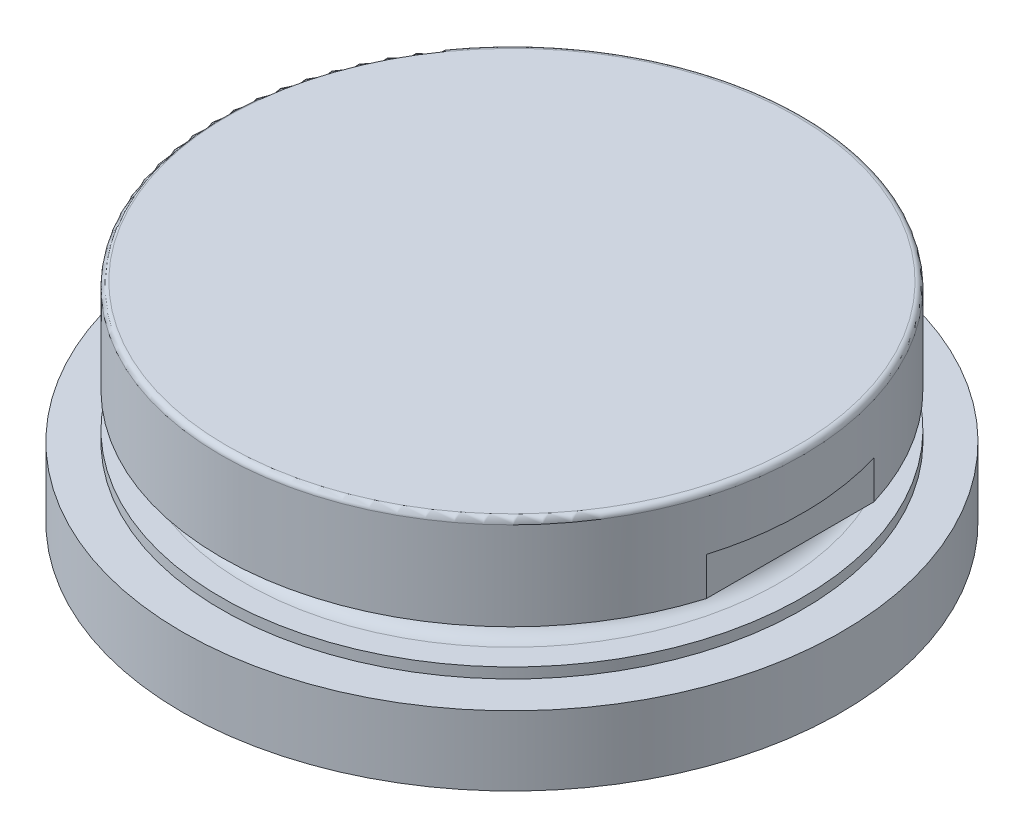
ISO-10303-21;
HEADER;
FILE_DESCRIPTION(('STEP AP214'),'2;1');
FILE_NAME('part.step','',(''),(''),'','','');
FILE_SCHEMA(('AUTOMOTIVE_DESIGN { 1 0 10303 214 1 1 1 1 }'));
ENDSEC;
DATA;
#1=APPLICATION_CONTEXT('core data for automotive mechanical design processes');
#2=APPLICATION_PROTOCOL_DEFINITION('international standard','automotive_design',2000,#1);
#3=PRODUCT_CONTEXT('',#1,'mechanical');
#4=PRODUCT('Part','Part','',(#3));
#5=PRODUCT_RELATED_PRODUCT_CATEGORY('part','',(#4));
#6=PRODUCT_DEFINITION_FORMATION('','',#4);
#7=PRODUCT_DEFINITION_CONTEXT('part definition',#1,'design');
#8=PRODUCT_DEFINITION('design','',#6,#7);
#9=PRODUCT_DEFINITION_SHAPE('','',#8);
#10=(LENGTH_UNIT() NAMED_UNIT(*) SI_UNIT(.MILLI.,.METRE.));
#11=(NAMED_UNIT(*) PLANE_ANGLE_UNIT() SI_UNIT($,.RADIAN.));
#12=(NAMED_UNIT(*) SI_UNIT($,.STERADIAN.) SOLID_ANGLE_UNIT());
#13=UNCERTAINTY_MEASURE_WITH_UNIT(LENGTH_MEASURE(1.E-05),#10,'distance_accuracy_value','');
#14=(GEOMETRIC_REPRESENTATION_CONTEXT(3) GLOBAL_UNCERTAINTY_ASSIGNED_CONTEXT((#13)) GLOBAL_UNIT_ASSIGNED_CONTEXT((#10,
#11,#12)) REPRESENTATION_CONTEXT('',''));
#15=CARTESIAN_POINT('',(0.,0.,0.));
#16=DIRECTION('',(0.,0.,1.));
#17=DIRECTION('',(1.,0.,0.));
#18=AXIS2_PLACEMENT_3D('',#15,#16,#17);
#19=CARTESIAN_POINT('',(0.,19.05,0.));
#20=DIRECTION('',(0.,-1.,0.));
#21=DIRECTION('',(0.,0.,-1.));
#22=AXIS2_PLACEMENT_3D('',#19,#20,#21);
#23=CYLINDRICAL_SURFACE('',#22,26.543);
#24=CARTESIAN_POINT('',(0.,6.35,0.));
#25=DIRECTION('',(0.,1.,0.));
#26=DIRECTION('',(0.,0.,1.));
#27=AXIS2_PLACEMENT_3D('',#24,#25,#26);
#28=CIRCLE('',#27,26.543);
#29=CARTESIAN_POINT('',(0.,6.35,-26.543));
#30=VERTEX_POINT('',#29);
#31=EDGE_CURVE('E171',#30,#30,#28,.F.);
#32=CARTESIAN_POINT('',(0.,7.3025,0.));
#33=DIRECTION('',(0.,1.,0.));
#34=DIRECTION('',(0.,0.,1.));
#35=AXIS2_PLACEMENT_3D('',#32,#33,#34);
#36=CIRCLE('',#35,26.543);
#37=CARTESIAN_POINT('',(0.,7.30249999999999,-26.543));
#38=VERTEX_POINT('',#37);
#39=EDGE_CURVE('E39',#38,#38,#36,.T.);
#40=CARTESIAN_POINT('',(0.,6.35,-26.543));
#41=CARTESIAN_POINT('',(0.,6.359921875,-26.543));
#42=CARTESIAN_POINT('',(0.,6.36984375,-26.543));
#43=CARTESIAN_POINT('',(0.,6.3896875,-26.543));
#44=CARTESIAN_POINT('',(0.,6.399609375,-26.543));
#45=CARTESIAN_POINT('',(0.,6.419453125,-26.543));
#46=CARTESIAN_POINT('',(0.,6.429375,-26.543));
#47=CARTESIAN_POINT('',(0.,6.44921875,-26.543));
#48=CARTESIAN_POINT('',(0.,6.459140625,-26.543));
#49=CARTESIAN_POINT('',(0.,6.478984375,-26.543));
#50=CARTESIAN_POINT('',(0.,6.48890625,-26.543));
#51=CARTESIAN_POINT('',(0.,6.50875,-26.543));
#52=CARTESIAN_POINT('',(0.,6.518671875,-26.543));
#53=CARTESIAN_POINT('',(0.,6.538515625,-26.543));
#54=CARTESIAN_POINT('',(0.,6.5484375,-26.543));
#55=CARTESIAN_POINT('',(0.,6.56828125,-26.543));
#56=CARTESIAN_POINT('',(0.,6.578203125,-26.543));
#57=CARTESIAN_POINT('',(0.,6.598046875,-26.543));
#58=CARTESIAN_POINT('',(0.,6.60796875,-26.543));
#59=CARTESIAN_POINT('',(0.,6.6278125,-26.543));
#60=CARTESIAN_POINT('',(0.,6.637734375,-26.543));
#61=CARTESIAN_POINT('',(0.,6.657578125,-26.543));
#62=CARTESIAN_POINT('',(0.,6.6675,-26.543));
#63=CARTESIAN_POINT('',(0.,6.68734375,-26.543));
#64=CARTESIAN_POINT('',(0.,6.697265625,-26.543));
#65=CARTESIAN_POINT('',(0.,6.717109375,-26.543));
#66=CARTESIAN_POINT('',(0.,6.72703125,-26.543));
#67=CARTESIAN_POINT('',(0.,6.746875,-26.543));
#68=CARTESIAN_POINT('',(0.,6.756796875,-26.543));
#69=CARTESIAN_POINT('',(0.,6.776640625,-26.543));
#70=CARTESIAN_POINT('',(0.,6.7865625,-26.543));
#71=CARTESIAN_POINT('',(0.,6.80640625,-26.543));
#72=CARTESIAN_POINT('',(0.,6.816328125,-26.543));
#73=CARTESIAN_POINT('',(0.,6.836171875,-26.543));
#74=CARTESIAN_POINT('',(0.,6.84609375,-26.543));
#75=CARTESIAN_POINT('',(0.,6.8659375,-26.543));
#76=CARTESIAN_POINT('',(0.,6.875859375,-26.543));
#77=CARTESIAN_POINT('',(0.,6.895703125,-26.543));
#78=CARTESIAN_POINT('',(0.,6.905625,-26.543));
#79=CARTESIAN_POINT('',(0.,6.92546875,-26.543));
#80=CARTESIAN_POINT('',(0.,6.935390625,-26.543));
#81=CARTESIAN_POINT('',(0.,6.955234375,-26.543));
#82=CARTESIAN_POINT('',(0.,6.96515625,-26.543));
#83=CARTESIAN_POINT('',(0.,6.985,-26.543));
#84=CARTESIAN_POINT('',(0.,6.994921875,-26.543));
#85=CARTESIAN_POINT('',(0.,7.014765625,-26.543));
#86=CARTESIAN_POINT('',(0.,7.0246875,-26.543));
#87=CARTESIAN_POINT('',(0.,7.04453125,-26.543));
#88=CARTESIAN_POINT('',(0.,7.054453125,-26.543));
#89=CARTESIAN_POINT('',(0.,7.074296875,-26.543));
#90=CARTESIAN_POINT('',(0.,7.08421875,-26.543));
#91=CARTESIAN_POINT('',(0.,7.1040625,-26.543));
#92=CARTESIAN_POINT('',(0.,7.113984375,-26.543));
#93=CARTESIAN_POINT('',(0.,7.133828125,-26.543));
#94=CARTESIAN_POINT('',(0.,7.14374999999999,-26.543));
#95=CARTESIAN_POINT('',(0.,7.16359374999999,-26.543));
#96=CARTESIAN_POINT('',(0.,7.173515625,-26.543));
#97=CARTESIAN_POINT('',(0.,7.193359375,-26.543));
#98=CARTESIAN_POINT('',(0.,7.20328125,-26.543));
#99=CARTESIAN_POINT('',(0.,7.223125,-26.543));
#100=CARTESIAN_POINT('',(0.,7.23304687499999,-26.543));
#101=CARTESIAN_POINT('',(0.,7.25289062499999,-26.543));
#102=CARTESIAN_POINT('',(0.,7.26281249999999,-26.543));
#103=CARTESIAN_POINT('',(0.,7.28265624999999,-26.543));
#104=CARTESIAN_POINT('',(0.,7.292578125,-26.543));
#105=CARTESIAN_POINT('',(0.,7.30249999999999,-26.543));
#106=B_SPLINE_CURVE_WITH_KNOTS('',3,(#40,#41,#42,#43,#44,#45,#46,#47,#48,#49,#50,#51,#52,#53,
#54,#55,#56,#57,#58,#59,#60,#61,#62,#63,#64,#65,#66,#67,#68,#69,#70,#71,#72,#73,#74,#75,#76,#77,
#78,#79,#80,#81,#82,#83,#84,#85,#86,#87,#88,#89,#90,#91,#92,#93,#94,#95,#96,#97,#98,#99,#100,
#101,#102,#103,#104,#105),.UNSPECIFIED.,.F.,.F.,(4,2,2,2,2,2,2,2,2,2,2,2,2,2,2,2,2,2,2,2,2,2,2,
2,2,2,2,2,2,2,2,2,4),(0.,0.0297656250000007,0.0595312499999997,0.0892968749999987,
0.119062499999999,0.148828125,0.178593749999999,0.208359374999998,0.238124999999999,
0.267890624999999,0.297656249999998,0.327421874999997,0.357187499999998,0.386953124999999,
0.416718749999998,0.446484374999997,0.476249999999998,0.506015624999998,0.535781249999997,
0.565546874999996,0.595312499999997,0.625078124999998,0.654843749999997,0.684609374999996,
0.714374999999996,0.744140624999997,0.773906249999996,0.803671874999995,0.833437499999996,
0.863203124999996,0.892968749999995,0.922734374999994,0.952499999999995),.UNSPECIFIED.);
#107=EDGE_CURVE('BSEAM35',#30,#38,#106,.T.);
#108=ORIENTED_EDGE('',*,*,#31,.F.);
#109=ORIENTED_EDGE('',*,*,#39,.F.);
#110=ORIENTED_EDGE('',*,*,#107,.T.);
#111=ORIENTED_EDGE('',*,*,#107,.F.);
#112=EDGE_LOOP('',(#108,#110,#109,#111));
#113=FACE_BOUND('',#112,.T.);
#114=ADVANCED_FACE('F35',(#113),#23,.T.);
#115=CARTESIAN_POINT('',(0.,6.35,0.));
#116=DIRECTION('',(0.,1.,0.));
#117=DIRECTION('',(0.,0.,1.));
#118=AXIS2_PLACEMENT_3D('',#115,#116,#117);
#119=PLANE('',#118);
#120=CARTESIAN_POINT('',(0.,6.35,0.));
#121=DIRECTION('',(0.,1.,0.));
#122=DIRECTION('',(0.,0.,1.));
#123=AXIS2_PLACEMENT_3D('',#120,#121,#122);
#124=CIRCLE('',#123,30.099);
#125=CARTESIAN_POINT('',(0.,6.35,30.099));
#126=VERTEX_POINT('',#125);
#127=EDGE_CURVE('E164',#126,#126,#124,.T.);
#128=ORIENTED_EDGE('',*,*,#127,.T.);
#129=EDGE_LOOP('',(#128));
#130=FACE_BOUND('',#129,.T.);
#131=ORIENTED_EDGE('',*,*,#31,.T.);
#132=EDGE_LOOP('',(#131));
#133=FACE_BOUND('',#132,.T.);
#134=ADVANCED_FACE('F141',(#130,#133),#119,.T.);
#135=CARTESIAN_POINT('',(0.,6.35,0.));
#136=DIRECTION('',(0.,-1.,0.));
#137=DIRECTION('',(0.,0.,-1.));
#138=AXIS2_PLACEMENT_3D('',#135,#136,#137);
#139=CYLINDRICAL_SURFACE('',#138,30.099);
#140=ORIENTED_EDGE('',*,*,#127,.F.);
#141=EDGE_LOOP('',(#140));
#142=FACE_BOUND('',#141,.T.);
#143=CARTESIAN_POINT('',(0.,0.,0.));
#144=DIRECTION('',(0.,1.,0.));
#145=DIRECTION('',(0.,0.,1.));
#146=AXIS2_PLACEMENT_3D('',#143,#144,#145);
#147=CIRCLE('',#146,30.099);
#148=CARTESIAN_POINT('',(0.,0.,30.099));
#149=VERTEX_POINT('',#148);
#150=EDGE_CURVE('E166',#149,#149,#147,.T.);
#151=ORIENTED_EDGE('',*,*,#150,.T.);
#152=EDGE_LOOP('',(#151));
#153=FACE_BOUND('',#152,.T.);
#154=ADVANCED_FACE('F210',(#142,#153),#139,.T.);
#155=CARTESIAN_POINT('',(0.,0.,0.));
#156=DIRECTION('',(0.,1.,0.));
#157=DIRECTION('',(0.,0.,1.));
#158=AXIS2_PLACEMENT_3D('',#155,#156,#157);
#159=PLANE('',#158);
#160=ORIENTED_EDGE('',*,*,#150,.F.);
#161=EDGE_LOOP('',(#160));
#162=FACE_BOUND('',#161,.T.);
#163=ADVANCED_FACE('F205',(#162),#159,.F.);
#164=CARTESIAN_POINT('',(-24.336375,7.3025,0.));
#165=DIRECTION('',(0.,1.,0.));
#166=DIRECTION('',(0.,0.,1.));
#167=AXIS2_PLACEMENT_3D('',#164,#165,#166);
#168=PLANE('',#167);
#169=CARTESIAN_POINT('',(0.,7.3025,0.));
#170=DIRECTION('',(0.,-1.,0.));
#171=DIRECTION('',(0.,0.,-1.));
#172=AXIS2_PLACEMENT_3D('',#169,#170,#171);
#173=CIRCLE('',#172,24.336375);
#174=CARTESIAN_POINT('',(0.,7.3025,-24.336375));
#175=VERTEX_POINT('',#174);
#176=EDGE_CURVE('E313',#175,#175,#173,.T.);
#177=ORIENTED_EDGE('',*,*,#176,.T.);
#178=EDGE_LOOP('',(#177));
#179=FACE_BOUND('',#178,.T.);
#180=ORIENTED_EDGE('',*,*,#39,.T.);
#181=EDGE_LOOP('',(#180));
#182=FACE_BOUND('',#181,.T.);
#183=ADVANCED_FACE('F202',(#179,#182),#168,.T.);
#184=CARTESIAN_POINT('',(-24.336375,10.4775,0.));
#185=DIRECTION('',(0.,-1.,0.));
#186=DIRECTION('',(0.,0.,-1.));
#187=AXIS2_PLACEMENT_3D('',#184,#185,#186);
#188=PLANE('',#187);
#189=CARTESIAN_POINT('',(0.,10.4775,0.));
#190=DIRECTION('',(0.,-1.,0.));
#191=DIRECTION('',(0.,0.,-1.));
#192=AXIS2_PLACEMENT_3D('',#189,#190,#191);
#193=CIRCLE('',#192,24.336375);
#194=CARTESIAN_POINT('',(0.,10.4775,-24.336375));
#195=VERTEX_POINT('',#194);
#196=EDGE_CURVE('E315',#195,#195,#193,.T.);
#197=ORIENTED_EDGE('',*,*,#196,.F.);
#198=EDGE_LOOP('',(#197));
#199=FACE_BOUND('',#198,.T.);
#200=DIRECTION('',(0.,0.,-1.));
#201=VECTOR('',#200,1.);
#202=CARTESIAN_POINT('',(-25.4146964445081,10.4775,-7.65663461538461));
#203=LINE('',#202,#201);
#204=CARTESIAN_POINT('',(-25.4146964445081,10.4775,7.65663461538462));
#205=VERTEX_POINT('',#204);
#206=CARTESIAN_POINT('',(-25.4146964445081,10.4775,-7.65663461538461));
#207=VERTEX_POINT('',#206);
#208=EDGE_CURVE('E88',#205,#207,#203,.T.);
#209=ORIENTED_EDGE('',*,*,#208,.T.);
#210=CARTESIAN_POINT('',(0.,10.4775,0.));
#211=DIRECTION('',(0.,-1.,0.));
#212=DIRECTION('',(0.,0.,-1.));
#213=AXIS2_PLACEMENT_3D('',#210,#211,#212);
#214=CIRCLE('',#213,26.543);
#215=CARTESIAN_POINT('',(25.4146964445081,10.4775,-7.65663461538461));
#216=VERTEX_POINT('',#215);
#217=EDGE_CURVE('E51',#207,#216,#214,.T.);
#218=ORIENTED_EDGE('',*,*,#217,.T.);
#219=DIRECTION('',(0.,0.,1.));
#220=VECTOR('',#219,1.);
#221=CARTESIAN_POINT('',(25.4146964445081,10.4775,-7.65663461538461));
#222=LINE('',#221,#220);
#223=CARTESIAN_POINT('',(25.4146964445081,10.4775,7.65663461538462));
#224=VERTEX_POINT('',#223);
#225=EDGE_CURVE('E11',#216,#224,#222,.T.);
#226=ORIENTED_EDGE('',*,*,#225,.T.);
#227=EDGE_CURVE('E77',#224,#205,#214,.T.);
#228=ORIENTED_EDGE('',*,*,#227,.T.);
#229=EDGE_LOOP('',(#209,#218,#226,#228));
#230=FACE_BOUND('',#229,.T.);
#231=ADVANCED_FACE('F76',(#199,#230),#188,.T.);
#232=CARTESIAN_POINT('',(0.,8.89,0.));
#233=DIRECTION('',(0.,-1.,0.));
#234=DIRECTION('',(0.,0.,-1.));
#235=AXIS2_PLACEMENT_3D('',#232,#233,#234);
#236=TOROIDAL_SURFACE('',#235,24.336375,1.5875);
#237=ORIENTED_EDGE('',*,*,#196,.T.);
#238=EDGE_LOOP('',(#237));
#239=FACE_BOUND('',#238,.T.);
#240=ORIENTED_EDGE('',*,*,#176,.F.);
#241=EDGE_LOOP('',(#240));
#242=FACE_BOUND('',#241,.T.);
#243=ADVANCED_FACE('F135',(#239,#242),#236,.F.);
#244=CARTESIAN_POINT('',(0.,19.05,0.));
#245=DIRECTION('',(0.,1.,0.));
#246=DIRECTION('',(0.,0.,1.));
#247=AXIS2_PLACEMENT_3D('',#244,#245,#246);
#248=PLANE('',#247);
#249=CARTESIAN_POINT('',(0.,19.05,0.));
#250=DIRECTION('',(0.,1.,0.));
#251=DIRECTION('',(0.,0.,1.));
#252=AXIS2_PLACEMENT_3D('',#249,#250,#251);
#253=CIRCLE('',#252,26.035);
#254=CARTESIAN_POINT('',(0.,19.05,26.035));
#255=VERTEX_POINT('',#254);
#256=EDGE_CURVE('E152',#255,#255,#253,.T.);
#257=ORIENTED_EDGE('',*,*,#256,.T.);
#258=EDGE_LOOP('',(#257));
#259=FACE_BOUND('',#258,.T.);
#260=ADVANCED_FACE('F132',(#259),#248,.T.);
#261=CARTESIAN_POINT('',(0.,18.542,0.));
#262=DIRECTION('',(0.,1.,0.));
#263=DIRECTION('',(0.,0.,1.));
#264=AXIS2_PLACEMENT_3D('',#261,#262,#263);
#265=TOROIDAL_SURFACE('',#264,26.035,0.508);
#266=CARTESIAN_POINT('',(0.,18.542,0.));
#267=DIRECTION('',(0.,1.,0.));
#268=DIRECTION('',(0.,0.,1.));
#269=AXIS2_PLACEMENT_3D('',#266,#267,#268);
#270=CIRCLE('',#269,26.543);
#271=CARTESIAN_POINT('',(0.,18.542,26.543));
#272=VERTEX_POINT('',#271);
#273=EDGE_CURVE('E44',#272,#272,#270,.F.);
#274=ORIENTED_EDGE('',*,*,#273,.F.);
#275=EDGE_LOOP('',(#274));
#276=FACE_BOUND('',#275,.T.);
#277=ORIENTED_EDGE('',*,*,#256,.F.);
#278=EDGE_LOOP('',(#277));
#279=FACE_BOUND('',#278,.T.);
#280=ADVANCED_FACE('F37',(#276,#279),#265,.T.);
#281=CARTESIAN_POINT('',(-0.132667206994147,13.97,0.));
#282=DIRECTION('',(0.,1.,0.));
#283=DIRECTION('',(0.,0.,1.));
#284=AXIS2_PLACEMENT_3D('',#281,#282,#283);
#285=PLANE('',#284);
#286=DIRECTION('',(0.,0.,-1.));
#287=VECTOR('',#286,1.);
#288=CARTESIAN_POINT('',(-25.4146964445081,13.97,-7.65663461538461));
#289=LINE('',#288,#287);
#290=CARTESIAN_POINT('',(-25.4146964445081,13.97,7.65663461538461));
#291=VERTEX_POINT('',#290);
#292=CARTESIAN_POINT('',(-25.4146964445081,13.97,-7.65663461538461));
#293=VERTEX_POINT('',#292);
#294=EDGE_CURVE('E92',#291,#293,#289,.T.);
#295=ORIENTED_EDGE('',*,*,#294,.F.);
#296=CARTESIAN_POINT('',(0.,13.97,0.));
#297=DIRECTION('',(0.,1.,0.));
#298=DIRECTION('',(-0.957491483423431,0.,-0.288461538461538));
#299=AXIS2_PLACEMENT_3D('',#296,#297,#298);
#300=CIRCLE('',#299,26.543);
#301=EDGE_CURVE('E110',#293,#291,#300,.T.);
#302=ORIENTED_EDGE('',*,*,#301,.F.);
#303=EDGE_LOOP('',(#295,#302));
#304=FACE_BOUND('',#303,.T.);
#305=ADVANCED_FACE('F116',(#304),#285,.F.);
#306=CARTESIAN_POINT('',(0.132667206994272,13.97,0.));
#307=DIRECTION('',(0.,-1.,0.));
#308=DIRECTION('',(0.,0.,-1.));
#309=AXIS2_PLACEMENT_3D('',#306,#307,#308);
#310=PLANE('',#309);
#311=CARTESIAN_POINT('',(25.4146964445081,13.97,-7.65663461538461));
#312=CARTESIAN_POINT('',(26.5429060522802,13.97,-3.9117641667293));
#313=CARTESIAN_POINT('',(26.543,13.97,0.));
#314=CARTESIAN_POINT('',(26.5430939327422,13.97,3.91114053439622));
#315=CARTESIAN_POINT('',(25.4146964445081,13.97,7.65663461538461));
#316=B_SPLINE_CURVE_WITH_KNOTS('',2,(#311,#312,#313,#314,#315),.UNSPECIFIED.,.F.,.F.,(3,2,3),
(0.,0.5,1.),.UNSPECIFIED.);
#317=CARTESIAN_POINT('',(25.4146964445081,13.97,-7.65663461538461));
#318=VERTEX_POINT('',#317);
#319=CARTESIAN_POINT('',(25.4146964445081,13.97,7.65663461538462));
#320=VERTEX_POINT('',#319);
#321=EDGE_CURVE('E159',#318,#320,#316,.T.);
#322=ORIENTED_EDGE('',*,*,#321,.T.);
#323=DIRECTION('',(0.,0.,1.));
#324=VECTOR('',#323,1.);
#325=CARTESIAN_POINT('',(25.4146964445081,13.97,-7.65663461538461));
#326=LINE('',#325,#324);
#327=EDGE_CURVE('E91',#318,#320,#326,.T.);
#328=ORIENTED_EDGE('',*,*,#327,.F.);
#329=EDGE_LOOP('',(#322,#328));
#330=FACE_BOUND('',#329,.T.);
#331=ADVANCED_FACE('F126',(#330),#310,.T.);
#332=CARTESIAN_POINT('',(-25.4146964445081,8.89,-7.65663461538461));
#333=DIRECTION('',(1.,0.,0.));
#334=DIRECTION('',(0.,0.,-1.));
#335=AXIS2_PLACEMENT_3D('',#332,#333,#334);
#336=PLANE('',#335);
#337=ORIENTED_EDGE('',*,*,#208,.F.);
#338=DIRECTION('',(0.,1.,0.));
#339=VECTOR('',#338,1.);
#340=CARTESIAN_POINT('',(-25.4146964445081,8.89,7.65663461538462));
#341=LINE('',#340,#339);
#342=EDGE_CURVE('E87',#205,#291,#341,.T.);
#343=ORIENTED_EDGE('',*,*,#342,.T.);
#344=ORIENTED_EDGE('',*,*,#294,.T.);
#345=DIRECTION('',(0.,1.,0.));
#346=VECTOR('',#345,1.);
#347=CARTESIAN_POINT('',(-25.4146964445081,8.89,-7.65663461538461));
#348=LINE('',#347,#346);
#349=EDGE_CURVE('E176',#207,#293,#348,.T.);
#350=ORIENTED_EDGE('',*,*,#349,.F.);
#351=EDGE_LOOP('',(#337,#343,#344,#350));
#352=FACE_BOUND('',#351,.T.);
#353=ADVANCED_FACE('F128',(#352),#336,.F.);
#354=CARTESIAN_POINT('',(25.4146964445081,8.89,-7.65663461538461));
#355=DIRECTION('',(-1.,0.,0.));
#356=DIRECTION('',(0.,0.,1.));
#357=AXIS2_PLACEMENT_3D('',#354,#355,#356);
#358=PLANE('',#357);
#359=ORIENTED_EDGE('',*,*,#225,.F.);
#360=DIRECTION('',(0.,1.,0.));
#361=VECTOR('',#360,1.);
#362=CARTESIAN_POINT('',(25.4146964445081,8.89,-7.65663461538461));
#363=LINE('',#362,#361);
#364=EDGE_CURVE('E58',#216,#318,#363,.T.);
#365=ORIENTED_EDGE('',*,*,#364,.T.);
#366=ORIENTED_EDGE('',*,*,#327,.T.);
#367=DIRECTION('',(0.,1.,0.));
#368=VECTOR('',#367,1.);
#369=CARTESIAN_POINT('',(25.4146964445081,8.89,7.65663461538462));
#370=LINE('',#369,#368);
#371=EDGE_CURVE('E84',#224,#320,#370,.T.);
#372=ORIENTED_EDGE('',*,*,#371,.F.);
#373=EDGE_LOOP('',(#359,#365,#366,#372));
#374=FACE_BOUND('',#373,.T.);
#375=ADVANCED_FACE('F90',(#374),#358,.F.);
#376=ORIENTED_EDGE('',*,*,#273,.T.);
#377=EDGE_LOOP('',(#376));
#378=FACE_BOUND('',#377,.T.);
#379=ORIENTED_EDGE('',*,*,#227,.F.);
#380=ORIENTED_EDGE('',*,*,#371,.T.);
#381=ORIENTED_EDGE('',*,*,#321,.F.);
#382=ORIENTED_EDGE('',*,*,#364,.F.);
#383=ORIENTED_EDGE('',*,*,#217,.F.);
#384=ORIENTED_EDGE('',*,*,#349,.T.);
#385=ORIENTED_EDGE('',*,*,#301,.T.);
#386=ORIENTED_EDGE('',*,*,#342,.F.);
#387=EDGE_LOOP('',(#379,#380,#381,#382,#383,#384,#385,#386));
#388=FACE_BOUND('',#387,.T.);
#389=ADVANCED_FACE('F82',(#378,#388),#23,.T.);
#390=CLOSED_SHELL('',(#114,#134,#154,#163,#183,#231,#243,#260,#280,#305,#331,#353,#375,#389));
#391=MANIFOLD_SOLID_BREP('B2',#390);
#392=ADVANCED_BREP_SHAPE_REPRESENTATION('',(#18,#391),#14);
#393=SHAPE_DEFINITION_REPRESENTATION(#9,#392);
ENDSEC;
END-ISO-10303-21;
